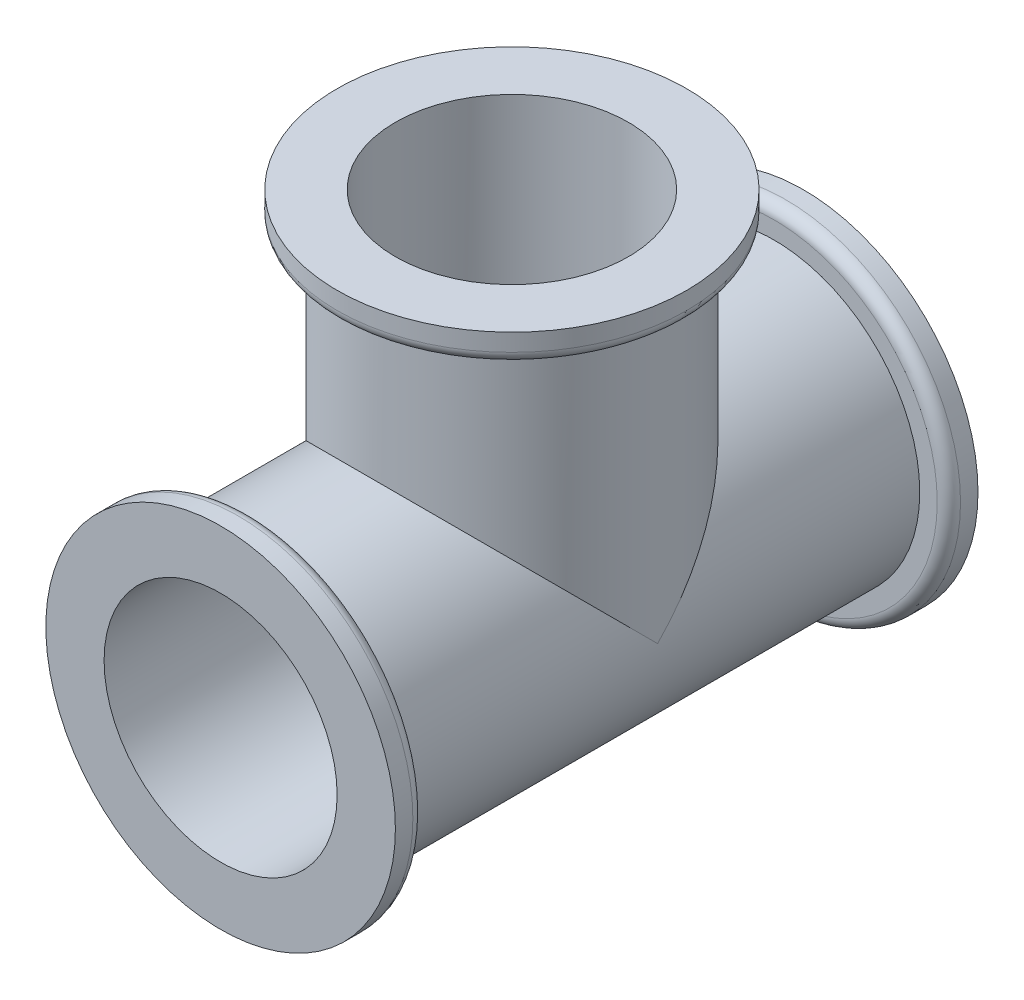
ISO-10303-21;
HEADER;
FILE_DESCRIPTION(('STEP AP214'),'2;1');
FILE_NAME('part.step','',(''),(''),'','','');
FILE_SCHEMA(('AUTOMOTIVE_DESIGN { 1 0 10303 214 1 1 1 1 }'));
ENDSEC;
DATA;
#1=APPLICATION_CONTEXT('core data for automotive mechanical design processes');
#2=APPLICATION_PROTOCOL_DEFINITION('international standard','automotive_design',2000,#1);
#3=PRODUCT_CONTEXT('',#1,'mechanical');
#4=PRODUCT('Part','Part','',(#3));
#5=PRODUCT_RELATED_PRODUCT_CATEGORY('part','',(#4));
#6=PRODUCT_DEFINITION_FORMATION('','',#4);
#7=PRODUCT_DEFINITION_CONTEXT('part definition',#1,'design');
#8=PRODUCT_DEFINITION('design','',#6,#7);
#9=PRODUCT_DEFINITION_SHAPE('','',#8);
#10=(LENGTH_UNIT() NAMED_UNIT(*) SI_UNIT(.MILLI.,.METRE.));
#11=(NAMED_UNIT(*) PLANE_ANGLE_UNIT() SI_UNIT($,.RADIAN.));
#12=(NAMED_UNIT(*) SI_UNIT($,.STERADIAN.) SOLID_ANGLE_UNIT());
#13=UNCERTAINTY_MEASURE_WITH_UNIT(LENGTH_MEASURE(1.E-05),#10,'distance_accuracy_value','');
#14=(GEOMETRIC_REPRESENTATION_CONTEXT(3) GLOBAL_UNCERTAINTY_ASSIGNED_CONTEXT((#13)) GLOBAL_UNIT_ASSIGNED_CONTEXT((#10,
#11,#12)) REPRESENTATION_CONTEXT('',''));
#15=CARTESIAN_POINT('',(0.,0.,0.));
#16=DIRECTION('',(0.,0.,1.));
#17=DIRECTION('',(1.,0.,0.));
#18=AXIS2_PLACEMENT_3D('',#15,#16,#17);
#19=CARTESIAN_POINT('',(0.,0.,-45.));
#20=DIRECTION('',(0.,0.,1.));
#21=DIRECTION('',(1.,0.,0.));
#22=AXIS2_PLACEMENT_3D('',#19,#20,#21);
#23=CYLINDRICAL_SURFACE('',#22,12.5);
#24=CARTESIAN_POINT('',(0.,0.,0.));
#25=DIRECTION('',(0.,0.,1.));
#26=DIRECTION('',(1.,0.,0.));
#27=AXIS2_PLACEMENT_3D('',#24,#25,#26);
#28=CIRCLE('',#27,12.5);
#29=CARTESIAN_POINT('',(12.5,0.,0.));
#30=VERTEX_POINT('',#29);
#31=EDGE_CURVE('E181',#30,#30,#28,.F.);
#32=ORIENTED_EDGE('',*,*,#31,.T.);
#33=EDGE_LOOP('',(#32));
#34=FACE_BOUND('',#33,.T.);
#35=CARTESIAN_POINT('',(0.,0.,-45.));
#36=DIRECTION('',(0.,0.,-1.));
#37=DIRECTION('',(-1.,0.,0.));
#38=AXIS2_PLACEMENT_3D('',#35,#36,#37);
#39=CIRCLE('',#38,12.5);
#40=CARTESIAN_POINT('',(-12.5,0.,-45.));
#41=VERTEX_POINT('',#40);
#42=EDGE_CURVE('E193',#41,#41,#39,.T.);
#43=ORIENTED_EDGE('',*,*,#42,.F.);
#44=EDGE_LOOP('',(#43));
#45=FACE_BOUND('',#44,.T.);
#46=CARTESIAN_POINT('',(0.,0.,-22.5));
#47=DIRECTION('',(0.,-0.707106781186548,0.707106781186547));
#48=DIRECTION('',(0.,0.707106781186548,0.707106781186547));
#49=AXIS2_PLACEMENT_3D('',#46,#47,#48);
#50=ELLIPSE('',#49,17.6776695296637,12.5);
#51=CARTESIAN_POINT('',(-12.5,0.,-22.5));
#52=VERTEX_POINT('',#51);
#53=CARTESIAN_POINT('',(12.5,0.,-22.5));
#54=VERTEX_POINT('',#53);
#55=EDGE_CURVE('E157',#52,#54,#50,.F.);
#56=ORIENTED_EDGE('',*,*,#55,.F.);
#57=CARTESIAN_POINT('',(0.,0.,-22.5));
#58=DIRECTION('',(0.,0.707106781186548,0.707106781186547));
#59=DIRECTION('',(0.,-0.707106781186548,0.707106781186547));
#60=AXIS2_PLACEMENT_3D('',#57,#58,#59);
#61=ELLIPSE('',#60,17.6776695296637,12.5);
#62=EDGE_CURVE('E161',#54,#52,#61,.T.);
#63=ORIENTED_EDGE('',*,*,#62,.F.);
#64=EDGE_LOOP('',(#56,#63));
#65=FACE_BOUND('',#64,.T.);
#66=ADVANCED_FACE('F75',(#34,#45,#65),#23,.T.);
#67=CARTESIAN_POINT('',(0.,0.,0.));
#68=DIRECTION('',(0.,0.,1.));
#69=DIRECTION('',(1.,0.,0.));
#70=AXIS2_PLACEMENT_3D('',#67,#68,#69);
#71=PLANE('',#70);
#72=CARTESIAN_POINT('',(0.,0.,0.));
#73=DIRECTION('',(0.,0.,1.));
#74=DIRECTION('',(1.,0.,0.));
#75=AXIS2_PLACEMENT_3D('',#72,#73,#74);
#76=CIRCLE('',#75,14.);
#77=CARTESIAN_POINT('',(14.,0.,0.));
#78=VERTEX_POINT('',#77);
#79=EDGE_CURVE('E165',#78,#78,#76,.F.);
#80=ORIENTED_EDGE('',*,*,#79,.T.);
#81=EDGE_LOOP('',(#80));
#82=FACE_BOUND('',#81,.T.);
#83=ORIENTED_EDGE('',*,*,#31,.F.);
#84=EDGE_LOOP('',(#83));
#85=FACE_BOUND('',#84,.T.);
#86=ADVANCED_FACE('F237',(#82,#85),#71,.F.);
#87=CARTESIAN_POINT('',(0.,0.,2.5));
#88=DIRECTION('',(0.,0.,1.));
#89=DIRECTION('',(1.,0.,0.));
#90=AXIS2_PLACEMENT_3D('',#87,#88,#89);
#91=PLANE('',#90);
#92=CARTESIAN_POINT('',(0.,0.,2.5));
#93=DIRECTION('',(0.,0.,1.));
#94=DIRECTION('',(1.,0.,0.));
#95=AXIS2_PLACEMENT_3D('',#92,#93,#94);
#96=CIRCLE('',#95,15.);
#97=CARTESIAN_POINT('',(15.,0.,2.5));
#98=VERTEX_POINT('',#97);
#99=EDGE_CURVE('E185',#98,#98,#96,.T.);
#100=ORIENTED_EDGE('',*,*,#99,.T.);
#101=EDGE_LOOP('',(#100));
#102=FACE_BOUND('',#101,.T.);
#103=CARTESIAN_POINT('',(0.,0.,2.5));
#104=DIRECTION('',(0.,0.,1.));
#105=DIRECTION('',(1.,0.,0.));
#106=AXIS2_PLACEMENT_3D('',#103,#104,#105);
#107=CIRCLE('',#106,10.);
#108=CARTESIAN_POINT('',(10.,0.,2.5));
#109=VERTEX_POINT('',#108);
#110=EDGE_CURVE('E189',#109,#109,#107,.T.);
#111=ORIENTED_EDGE('',*,*,#110,.F.);
#112=EDGE_LOOP('',(#111));
#113=FACE_BOUND('',#112,.T.);
#114=ADVANCED_FACE('F244',(#102,#113),#91,.T.);
#115=CARTESIAN_POINT('',(0.,0.,2.5));
#116=DIRECTION('',(0.,0.,-1.));
#117=DIRECTION('',(-1.,0.,0.));
#118=AXIS2_PLACEMENT_3D('',#115,#116,#117);
#119=CYLINDRICAL_SURFACE('',#118,15.);
#120=CARTESIAN_POINT('',(0.,0.,1.));
#121=DIRECTION('',(0.,0.,1.));
#122=DIRECTION('',(1.,0.,0.));
#123=AXIS2_PLACEMENT_3D('',#120,#121,#122);
#124=CIRCLE('',#123,15.);
#125=CARTESIAN_POINT('',(15.,0.,1.));
#126=VERTEX_POINT('',#125);
#127=EDGE_CURVE('E169',#126,#126,#124,.T.);
#128=ORIENTED_EDGE('',*,*,#127,.T.);
#129=EDGE_LOOP('',(#128));
#130=FACE_BOUND('',#129,.T.);
#131=ORIENTED_EDGE('',*,*,#99,.F.);
#132=EDGE_LOOP('',(#131));
#133=FACE_BOUND('',#132,.T.);
#134=ADVANCED_FACE('F256',(#130,#133),#119,.T.);
#135=CARTESIAN_POINT('',(0.,0.,-47.5));
#136=DIRECTION('',(0.,0.,1.));
#137=DIRECTION('',(1.,0.,0.));
#138=AXIS2_PLACEMENT_3D('',#135,#136,#137);
#139=CYLINDRICAL_SURFACE('',#138,15.);
#140=CARTESIAN_POINT('',(0.,0.,-46.));
#141=DIRECTION('',(0.,0.,1.));
#142=DIRECTION('',(1.,0.,0.));
#143=AXIS2_PLACEMENT_3D('',#140,#141,#142);
#144=CIRCLE('',#143,15.);
#145=CARTESIAN_POINT('',(15.,0.,-46.));
#146=VERTEX_POINT('',#145);
#147=EDGE_CURVE('E173',#146,#146,#144,.F.);
#148=ORIENTED_EDGE('',*,*,#147,.T.);
#149=EDGE_LOOP('',(#148));
#150=FACE_BOUND('',#149,.T.);
#151=CARTESIAN_POINT('',(0.,0.,-47.5));
#152=DIRECTION('',(0.,0.,1.));
#153=DIRECTION('',(1.,0.,0.));
#154=AXIS2_PLACEMENT_3D('',#151,#152,#153);
#155=CIRCLE('',#154,15.);
#156=CARTESIAN_POINT('',(15.,0.,-47.5));
#157=VERTEX_POINT('',#156);
#158=EDGE_CURVE('E197',#157,#157,#155,.T.);
#159=ORIENTED_EDGE('',*,*,#158,.T.);
#160=EDGE_LOOP('',(#159));
#161=FACE_BOUND('',#160,.T.);
#162=ADVANCED_FACE('F250',(#150,#161),#139,.T.);
#163=CARTESIAN_POINT('',(0.,0.,-47.5));
#164=DIRECTION('',(0.,0.,1.));
#165=DIRECTION('',(1.,0.,0.));
#166=AXIS2_PLACEMENT_3D('',#163,#164,#165);
#167=PLANE('',#166);
#168=CARTESIAN_POINT('',(0.,0.,-47.5));
#169=DIRECTION('',(0.,0.,1.));
#170=DIRECTION('',(1.,0.,0.));
#171=AXIS2_PLACEMENT_3D('',#168,#169,#170);
#172=CIRCLE('',#171,10.);
#173=CARTESIAN_POINT('',(10.,0.,-47.5));
#174=VERTEX_POINT('',#173);
#175=EDGE_CURVE('E201',#174,#174,#172,.T.);
#176=ORIENTED_EDGE('',*,*,#175,.T.);
#177=EDGE_LOOP('',(#176));
#178=FACE_BOUND('',#177,.T.);
#179=ORIENTED_EDGE('',*,*,#158,.F.);
#180=EDGE_LOOP('',(#179));
#181=FACE_BOUND('',#180,.T.);
#182=ADVANCED_FACE('F279',(#178,#181),#167,.F.);
#183=CARTESIAN_POINT('',(0.,0.,-45.));
#184=DIRECTION('',(0.,0.,1.));
#185=DIRECTION('',(1.,0.,0.));
#186=AXIS2_PLACEMENT_3D('',#183,#184,#185);
#187=PLANE('',#186);
#188=CARTESIAN_POINT('',(0.,0.,-45.));
#189=DIRECTION('',(0.,0.,1.));
#190=DIRECTION('',(1.,0.,0.));
#191=AXIS2_PLACEMENT_3D('',#188,#189,#190);
#192=CIRCLE('',#191,14.);
#193=CARTESIAN_POINT('',(14.,0.,-45.));
#194=VERTEX_POINT('',#193);
#195=EDGE_CURVE('E177',#194,#194,#192,.T.);
#196=ORIENTED_EDGE('',*,*,#195,.T.);
#197=EDGE_LOOP('',(#196));
#198=FACE_BOUND('',#197,.T.);
#199=ORIENTED_EDGE('',*,*,#42,.T.);
#200=EDGE_LOOP('',(#199));
#201=FACE_BOUND('',#200,.T.);
#202=ADVANCED_FACE('F264',(#198,#201),#187,.T.);
#203=CARTESIAN_POINT('',(0.,0.,-46.));
#204=DIRECTION('',(0.,0.,1.));
#205=DIRECTION('',(1.,0.,0.));
#206=AXIS2_PLACEMENT_3D('',#203,#204,#205);
#207=TOROIDAL_SURFACE('',#206,14.,1.);
#208=ORIENTED_EDGE('',*,*,#147,.F.);
#209=EDGE_LOOP('',(#208));
#210=FACE_BOUND('',#209,.T.);
#211=ORIENTED_EDGE('',*,*,#195,.F.);
#212=EDGE_LOOP('',(#211));
#213=FACE_BOUND('',#212,.T.);
#214=ADVANCED_FACE('F262',(#210,#213),#207,.T.);
#215=CARTESIAN_POINT('',(0.,0.,1.));
#216=DIRECTION('',(0.,0.,1.));
#217=DIRECTION('',(1.,0.,0.));
#218=AXIS2_PLACEMENT_3D('',#215,#216,#217);
#219=TOROIDAL_SURFACE('',#218,14.,1.);
#220=ORIENTED_EDGE('',*,*,#79,.F.);
#221=EDGE_LOOP('',(#220));
#222=FACE_BOUND('',#221,.T.);
#223=ORIENTED_EDGE('',*,*,#127,.F.);
#224=EDGE_LOOP('',(#223));
#225=FACE_BOUND('',#224,.T.);
#226=ADVANCED_FACE('F232',(#222,#225),#219,.T.);
#227=CARTESIAN_POINT('',(0.,25.,-22.5));
#228=DIRECTION('',(0.,-1.,0.));
#229=DIRECTION('',(0.,0.,-1.));
#230=AXIS2_PLACEMENT_3D('',#227,#228,#229);
#231=CYLINDRICAL_SURFACE('',#230,12.5);
#232=CARTESIAN_POINT('',(0.,25.,-22.5));
#233=DIRECTION('',(0.,1.,0.));
#234=DIRECTION('',(1.,0.,0.));
#235=AXIS2_PLACEMENT_3D('',#232,#233,#234);
#236=CIRCLE('',#235,12.5);
#237=CARTESIAN_POINT('',(12.5,25.,-22.5));
#238=VERTEX_POINT('',#237);
#239=EDGE_CURVE('E205',#238,#238,#236,.T.);
#240=ORIENTED_EDGE('',*,*,#239,.F.);
#241=EDGE_LOOP('',(#240));
#242=FACE_BOUND('',#241,.T.);
#243=ORIENTED_EDGE('',*,*,#62,.T.);
#244=ORIENTED_EDGE('',*,*,#55,.T.);
#245=EDGE_LOOP('',(#243,#244));
#246=FACE_BOUND('',#245,.T.);
#247=ADVANCED_FACE('F222',(#242,#246),#231,.T.);
#248=CARTESIAN_POINT('',(0.,27.5,-22.5));
#249=DIRECTION('',(0.,1.,0.));
#250=DIRECTION('',(0.,0.,1.));
#251=AXIS2_PLACEMENT_3D('',#248,#249,#250);
#252=PLANE('',#251);
#253=CARTESIAN_POINT('',(0.,27.5,-22.5));
#254=DIRECTION('',(0.,1.,0.));
#255=DIRECTION('',(1.,0.,0.));
#256=AXIS2_PLACEMENT_3D('',#253,#254,#255);
#257=CIRCLE('',#256,15.);
#258=CARTESIAN_POINT('',(15.,27.5,-22.5));
#259=VERTEX_POINT('',#258);
#260=EDGE_CURVE('E209',#259,#259,#257,.T.);
#261=ORIENTED_EDGE('',*,*,#260,.T.);
#262=EDGE_LOOP('',(#261));
#263=FACE_BOUND('',#262,.T.);
#264=CARTESIAN_POINT('',(0.,27.5,-22.5));
#265=DIRECTION('',(0.,1.,0.));
#266=DIRECTION('',(0.,0.,1.));
#267=AXIS2_PLACEMENT_3D('',#264,#265,#266);
#268=CIRCLE('',#267,10.);
#269=CARTESIAN_POINT('',(0.,27.5,-12.5));
#270=VERTEX_POINT('',#269);
#271=EDGE_CURVE('E127',#270,#270,#268,.T.);
#272=ORIENTED_EDGE('',*,*,#271,.F.);
#273=EDGE_LOOP('',(#272));
#274=FACE_BOUND('',#273,.T.);
#275=ADVANCED_FACE('F219',(#263,#274),#252,.T.);
#276=CARTESIAN_POINT('',(0.,25.,-22.5));
#277=DIRECTION('',(0.,1.,0.));
#278=DIRECTION('',(0.,0.,1.));
#279=AXIS2_PLACEMENT_3D('',#276,#277,#278);
#280=PLANE('',#279);
#281=CARTESIAN_POINT('',(0.,25.,-22.5));
#282=DIRECTION('',(0.,1.,0.));
#283=DIRECTION('',(0.,0.,1.));
#284=AXIS2_PLACEMENT_3D('',#281,#282,#283);
#285=CIRCLE('',#284,14.);
#286=CARTESIAN_POINT('',(0.,25.,-8.5));
#287=VERTEX_POINT('',#286);
#288=EDGE_CURVE('E149',#287,#287,#285,.F.);
#289=ORIENTED_EDGE('',*,*,#288,.T.);
#290=EDGE_LOOP('',(#289));
#291=FACE_BOUND('',#290,.T.);
#292=ORIENTED_EDGE('',*,*,#239,.T.);
#293=EDGE_LOOP('',(#292));
#294=FACE_BOUND('',#293,.T.);
#295=ADVANCED_FACE('F221',(#291,#294),#280,.F.);
#296=CARTESIAN_POINT('',(0.,27.5,-22.5));
#297=DIRECTION('',(0.,-1.,0.));
#298=DIRECTION('',(0.,0.,-1.));
#299=AXIS2_PLACEMENT_3D('',#296,#297,#298);
#300=CYLINDRICAL_SURFACE('',#299,15.);
#301=CARTESIAN_POINT('',(0.,26.,-22.5));
#302=DIRECTION('',(0.,1.,0.));
#303=DIRECTION('',(0.,0.,1.));
#304=AXIS2_PLACEMENT_3D('',#301,#302,#303);
#305=CIRCLE('',#304,15.);
#306=CARTESIAN_POINT('',(0.,26.,-7.5));
#307=VERTEX_POINT('',#306);
#308=EDGE_CURVE('E153',#307,#307,#305,.T.);
#309=ORIENTED_EDGE('',*,*,#308,.T.);
#310=EDGE_LOOP('',(#309));
#311=FACE_BOUND('',#310,.T.);
#312=ORIENTED_EDGE('',*,*,#260,.F.);
#313=EDGE_LOOP('',(#312));
#314=FACE_BOUND('',#313,.T.);
#315=ADVANCED_FACE('F229',(#311,#314),#300,.T.);
#316=CARTESIAN_POINT('',(0.,25.,-22.5));
#317=DIRECTION('',(0.,-1.,0.));
#318=DIRECTION('',(0.,0.,-1.));
#319=AXIS2_PLACEMENT_3D('',#316,#317,#318);
#320=CYLINDRICAL_SURFACE('',#319,10.);
#321=ORIENTED_EDGE('',*,*,#271,.T.);
#322=EDGE_LOOP('',(#321));
#323=FACE_BOUND('',#322,.T.);
#324=CARTESIAN_POINT('',(0.,0.,-22.5));
#325=DIRECTION('',(0.,0.707106781186547,-0.707106781186547));
#326=DIRECTION('',(0.,-0.707106781186547,-0.707106781186547));
#327=AXIS2_PLACEMENT_3D('',#324,#325,#326);
#328=ELLIPSE('',#327,14.142135623731,10.);
#329=CARTESIAN_POINT('',(10.,0.,-22.5));
#330=VERTEX_POINT('',#329);
#331=CARTESIAN_POINT('',(-10.,0.,-22.5));
#332=VERTEX_POINT('',#331);
#333=EDGE_CURVE('E123',#330,#332,#328,.F.);
#334=ORIENTED_EDGE('',*,*,#333,.T.);
#335=CARTESIAN_POINT('',(0.,0.,-22.5));
#336=DIRECTION('',(0.,-0.707106781186547,-0.707106781186547));
#337=DIRECTION('',(0.,0.707106781186547,-0.707106781186547));
#338=AXIS2_PLACEMENT_3D('',#335,#336,#337);
#339=ELLIPSE('',#338,14.142135623731,10.);
#340=EDGE_CURVE('E142',#332,#330,#339,.T.);
#341=ORIENTED_EDGE('',*,*,#340,.T.);
#342=EDGE_LOOP('',(#334,#341));
#343=FACE_BOUND('',#342,.T.);
#344=ADVANCED_FACE('F217',(#323,#343),#320,.F.);
#345=CARTESIAN_POINT('',(0.,26.,-22.5));
#346=DIRECTION('',(0.,1.,0.));
#347=DIRECTION('',(0.,0.,1.));
#348=AXIS2_PLACEMENT_3D('',#345,#346,#347);
#349=TOROIDAL_SURFACE('',#348,14.,1.);
#350=ORIENTED_EDGE('',*,*,#288,.F.);
#351=EDGE_LOOP('',(#350));
#352=FACE_BOUND('',#351,.T.);
#353=ORIENTED_EDGE('',*,*,#308,.F.);
#354=EDGE_LOOP('',(#353));
#355=FACE_BOUND('',#354,.T.);
#356=ADVANCED_FACE('F77',(#352,#355),#349,.T.);
#357=CARTESIAN_POINT('',(0.,0.,2.5));
#358=DIRECTION('',(0.,0.,-1.));
#359=DIRECTION('',(-1.,0.,0.));
#360=AXIS2_PLACEMENT_3D('',#357,#358,#359);
#361=CYLINDRICAL_SURFACE('',#360,10.);
#362=CARTESIAN_POINT('',(0.,0.,-22.5));
#363=DIRECTION('',(0.,-0.707106781186547,-0.707106781186547));
#364=DIRECTION('',(0.,0.707106781186547,-0.707106781186547));
#365=AXIS2_PLACEMENT_3D('',#362,#363,#364);
#366=ELLIPSE('',#365,14.142135623731,10.);
#367=CARTESIAN_POINT('',(9.98749217771909,-0.500000000000014,-21.9999999999998));
#368=VERTEX_POINT('',#367);
#369=EDGE_CURVE('E12',#368,#330,#366,.F.);
#370=ORIENTED_EDGE('',*,*,#369,.F.);
#371=DIRECTION('',(0.,0.,-1.));
#372=VECTOR('',#371,1.);
#373=CARTESIAN_POINT('',(9.98749217771909,-0.500000000000014,2.5));
#374=LINE('',#373,#372);
#375=CARTESIAN_POINT('',(9.98749217771909,-0.500000000000014,-23.0000000000002));
#376=VERTEX_POINT('',#375);
#377=EDGE_CURVE('E79',#368,#376,#374,.T.);
#378=ORIENTED_EDGE('',*,*,#377,.T.);
#379=CARTESIAN_POINT('',(0.,0.,-22.5));
#380=DIRECTION('',(0.,0.707106781186547,-0.707106781186547));
#381=DIRECTION('',(0.,-0.707106781186547,-0.707106781186547));
#382=AXIS2_PLACEMENT_3D('',#379,#380,#381);
#383=ELLIPSE('',#382,14.142135623731,10.);
#384=EDGE_CURVE('E125',#330,#376,#383,.T.);
#385=ORIENTED_EDGE('',*,*,#384,.F.);
#386=ORIENTED_EDGE('',*,*,#340,.F.);
#387=CARTESIAN_POINT('',(-9.98749217771909,-0.500000000000014,-23.0000000000002));
#388=VERTEX_POINT('',#387);
#389=EDGE_CURVE('E138',#388,#332,#383,.T.);
#390=ORIENTED_EDGE('',*,*,#389,.F.);
#391=DIRECTION('',(0.,0.,-1.));
#392=VECTOR('',#391,1.);
#393=CARTESIAN_POINT('',(-9.98749217771909,-0.500000000000014,2.5));
#394=LINE('',#393,#392);
#395=CARTESIAN_POINT('',(-9.98749217771909,-0.500000000000014,-21.9999999999998));
#396=VERTEX_POINT('',#395);
#397=EDGE_CURVE('E146',#388,#396,#394,.F.);
#398=ORIENTED_EDGE('',*,*,#397,.T.);
#399=EDGE_CURVE('E86',#332,#396,#366,.F.);
#400=ORIENTED_EDGE('',*,*,#399,.F.);
#401=ORIENTED_EDGE('',*,*,#333,.F.);
#402=EDGE_LOOP('',(#370,#378,#385,#386,#390,#398,#400,#401));
#403=FACE_BOUND('',#402,.T.);
#404=ORIENTED_EDGE('',*,*,#110,.T.);
#405=EDGE_LOOP('',(#404));
#406=FACE_BOUND('',#405,.T.);
#407=ORIENTED_EDGE('',*,*,#175,.F.);
#408=EDGE_LOOP('',(#407));
#409=FACE_BOUND('',#408,.T.);
#410=ADVANCED_FACE('F130',(#403,#406,#409),#361,.F.);
#411=CARTESIAN_POINT('',(0.,-0.500000000000014,-22.5));
#412=DIRECTION('',(0.,1.,0.));
#413=DIRECTION('',(0.,0.,1.));
#414=AXIS2_PLACEMENT_3D('',#411,#412,#413);
#415=PLANE('',#414);
#416=CARTESIAN_POINT('',(0.,-0.500000000000014,-22.5));
#417=DIRECTION('',(0.,1.,0.));
#418=DIRECTION('',(0.,0.,1.));
#419=AXIS2_PLACEMENT_3D('',#416,#417,#418);
#420=CIRCLE('',#419,10.);
#421=EDGE_CURVE('E98',#388,#396,#420,.T.);
#422=ORIENTED_EDGE('',*,*,#421,.T.);
#423=ORIENTED_EDGE('',*,*,#397,.F.);
#424=EDGE_LOOP('',(#422,#423));
#425=FACE_BOUND('',#424,.T.);
#426=ADVANCED_FACE('F254',(#425),#415,.T.);
#427=CARTESIAN_POINT('',(0.,-0.500000000000014,-22.5));
#428=DIRECTION('',(0.,1.,0.));
#429=DIRECTION('',(0.,0.,1.));
#430=AXIS2_PLACEMENT_3D('',#427,#428,#429);
#431=CYLINDRICAL_SURFACE('',#430,10.);
#432=ORIENTED_EDGE('',*,*,#399,.T.);
#433=ORIENTED_EDGE('',*,*,#421,.F.);
#434=ORIENTED_EDGE('',*,*,#389,.T.);
#435=EDGE_LOOP('',(#432,#433,#434));
#436=FACE_BOUND('',#435,.T.);
#437=ADVANCED_FACE('F335',(#436),#431,.F.);
#438=EDGE_CURVE('E119',#368,#376,#420,.T.);
#439=ORIENTED_EDGE('',*,*,#438,.T.);
#440=ORIENTED_EDGE('',*,*,#377,.F.);
#441=EDGE_LOOP('',(#439,#440));
#442=FACE_BOUND('',#441,.T.);
#443=ADVANCED_FACE('F118',(#442),#415,.T.);
#444=ORIENTED_EDGE('',*,*,#384,.T.);
#445=ORIENTED_EDGE('',*,*,#438,.F.);
#446=ORIENTED_EDGE('',*,*,#369,.T.);
#447=EDGE_LOOP('',(#444,#445,#446));
#448=FACE_BOUND('',#447,.T.);
#449=ADVANCED_FACE('F124',(#448),#431,.F.);
#450=CLOSED_SHELL('',(#66,#86,#114,#134,#162,#182,#202,#214,#226,#247,#275,#295,#315,#344,#356,
#410,#426,#437,#443,#449));
#451=MANIFOLD_SOLID_BREP('B2',#450);
#452=ADVANCED_BREP_SHAPE_REPRESENTATION('',(#18,#451),#14);
#453=SHAPE_DEFINITION_REPRESENTATION(#9,#452);
ENDSEC;
END-ISO-10303-21;
